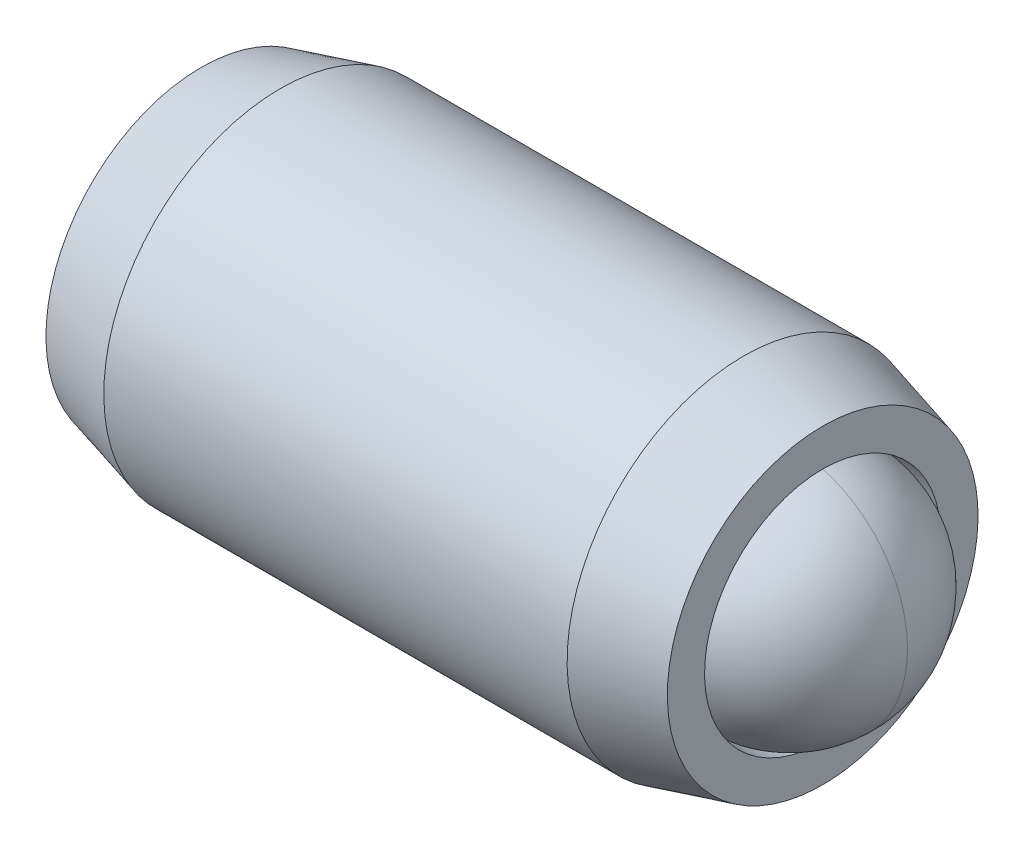
ISO-10303-21;
HEADER;
FILE_DESCRIPTION(('STEP AP214'),'2;1');
FILE_NAME('part.step','',(''),(''),'','','');
FILE_SCHEMA(('AUTOMOTIVE_DESIGN { 1 0 10303 214 1 1 1 1 }'));
ENDSEC;
DATA;
#1=APPLICATION_CONTEXT('core data for automotive mechanical design processes');
#2=APPLICATION_PROTOCOL_DEFINITION('international standard','automotive_design',2000,#1);
#3=PRODUCT_CONTEXT('',#1,'mechanical');
#4=PRODUCT('Part','Part','',(#3));
#5=PRODUCT_RELATED_PRODUCT_CATEGORY('part','',(#4));
#6=PRODUCT_DEFINITION_FORMATION('','',#4);
#7=PRODUCT_DEFINITION_CONTEXT('part definition',#1,'design');
#8=PRODUCT_DEFINITION('design','',#6,#7);
#9=PRODUCT_DEFINITION_SHAPE('','',#8);
#10=(LENGTH_UNIT() NAMED_UNIT(*) SI_UNIT(.MILLI.,.METRE.));
#11=(NAMED_UNIT(*) PLANE_ANGLE_UNIT() SI_UNIT($,.RADIAN.));
#12=(NAMED_UNIT(*) SI_UNIT($,.STERADIAN.) SOLID_ANGLE_UNIT());
#13=UNCERTAINTY_MEASURE_WITH_UNIT(LENGTH_MEASURE(1.E-05),#10,'distance_accuracy_value','');
#14=(GEOMETRIC_REPRESENTATION_CONTEXT(3) GLOBAL_UNCERTAINTY_ASSIGNED_CONTEXT((#13)) GLOBAL_UNIT_ASSIGNED_CONTEXT((#10,
#11,#12)) REPRESENTATION_CONTEXT('',''));
#15=CARTESIAN_POINT('',(0.,0.,0.));
#16=DIRECTION('',(0.,0.,1.));
#17=DIRECTION('',(1.,0.,0.));
#18=AXIS2_PLACEMENT_3D('',#15,#16,#17);
#19=CARTESIAN_POINT('',(-4.77872038568122,1.47543162631791,-0.69225443456844));
#20=DIRECTION('',(-1.,0.,0.));
#21=DIRECTION('',(0.,-1.,0.));
#22=AXIS2_PLACEMENT_3D('',#19,#20,#21);
#23=PLANE('',#22);
#24=DIRECTION('',(0.,0.866025403784439,0.5));
#25=VECTOR('',#24,1.);
#26=CARTESIAN_POINT('',(-4.77872038568122,2.59461912631791,-1.48506460734127));
#27=LINE('',#26,#25);
#28=CARTESIAN_POINT('',(-4.77872038568122,1.47543162631791,-2.13122781173993));
#29=VERTEX_POINT('',#28);
#30=CARTESIAN_POINT('',(-4.77872038568122,2.72161912631791,-1.41174112315419));
#31=VERTEX_POINT('',#30);
#32=EDGE_CURVE('P0_E164',#29,#31,#27,.T.);
#33=ORIENTED_EDGE('',*,*,#32,.T.);
#34=DIRECTION('',(0.,0.,1.));
#35=VECTOR('',#34,1.);
#36=CARTESIAN_POINT('',(-4.77872038568122,2.72161912631791,-0.119414714356857));
#37=LINE('',#36,#35);
#38=CARTESIAN_POINT('',(-4.77872038568122,2.72161912631791,0.0272322540173079));
#39=VERTEX_POINT('',#38);
#40=EDGE_CURVE('P0_E166',#31,#39,#37,.T.);
#41=ORIENTED_EDGE('',*,*,#40,.T.);
#42=DIRECTION('',(0.,-0.866025403784439,0.5));
#43=VECTOR('',#42,1.);
#44=CARTESIAN_POINT('',(-4.77872038568122,1.60243162631791,0.673395458415972));
#45=LINE('',#44,#43);
#46=CARTESIAN_POINT('',(-4.77872038568122,1.47543162631791,0.746718942603055));
#47=VERTEX_POINT('',#46);
#48=EDGE_CURVE('P0_E156',#39,#47,#45,.T.);
#49=ORIENTED_EDGE('',*,*,#48,.T.);
#50=DIRECTION('',(0.,-0.866025403784439,-0.5));
#51=VECTOR('',#50,1.);
#52=CARTESIAN_POINT('',(-4.77872038568122,0.356244126317912,0.100555738204391));
#53=LINE('',#52,#51);
#54=CARTESIAN_POINT('',(-4.77872038568122,0.229244126317913,0.0272322540173086));
#55=VERTEX_POINT('',#54);
#56=EDGE_CURVE('P0_E158',#47,#55,#53,.T.);
#57=ORIENTED_EDGE('',*,*,#56,.T.);
#58=DIRECTION('',(0.,0.,-1.));
#59=VECTOR('',#58,1.);
#60=CARTESIAN_POINT('',(-4.77872038568122,0.229244126317913,-1.26509415478002));
#61=LINE('',#60,#59);
#62=CARTESIAN_POINT('',(-4.77872038568122,0.229244126317913,-1.41174112315419));
#63=VERTEX_POINT('',#62);
#64=EDGE_CURVE('P0_E160',#55,#63,#61,.T.);
#65=ORIENTED_EDGE('',*,*,#64,.T.);
#66=DIRECTION('',(0.,0.866025403784439,-0.5));
#67=VECTOR('',#66,1.);
#68=CARTESIAN_POINT('',(-4.77872038568122,1.34843162631791,-2.05790432755285));
#69=LINE('',#68,#67);
#70=EDGE_CURVE('P0_E162',#63,#29,#69,.T.);
#71=ORIENTED_EDGE('',*,*,#70,.T.);
#72=EDGE_LOOP('',(#33,#41,#49,#57,#65,#71));
#73=FACE_BOUND('',#72,.T.);
#74=CARTESIAN_POINT('',(-4.77872038568122,1.47543162631791,-0.69225443456844));
#75=DIRECTION('',(1.,0.,0.));
#76=DIRECTION('',(0.,1.,0.));
#77=AXIS2_PLACEMENT_3D('',#74,#75,#76);
#78=CIRCLE('',#77,2.0955);
#79=CARTESIAN_POINT('',(-4.77872038568122,3.57093162631791,-0.69225443456844));
#80=VERTEX_POINT('',#79);
#81=EDGE_CURVE('P0_E150',#80,#80,#78,.T.);
#82=ORIENTED_EDGE('',*,*,#81,.F.);
#83=EDGE_LOOP('',(#82));
#84=FACE_BOUND('',#83,.T.);
#85=ADVANCED_FACE('P0_F17',(#73,#84),#23,.T.);
#86=CARTESIAN_POINT('',(-3.71228686741842,1.47543162631791,-0.69225443456844));
#87=DIRECTION('',(1.,0.,0.));
#88=DIRECTION('',(0.,1.,0.));
#89=AXIS2_PLACEMENT_3D('',#86,#87,#88);
#90=CONICAL_SURFACE('',#89,2.38125,0.26179938779915);
#91=ORIENTED_EDGE('',*,*,#81,.T.);
#92=EDGE_LOOP('',(#91));
#93=FACE_BOUND('',#92,.T.);
#94=CARTESIAN_POINT('',(-3.71228686741842,1.47543162631791,-0.69225443456844));
#95=DIRECTION('',(1.,0.,0.));
#96=DIRECTION('',(0.,1.,0.));
#97=AXIS2_PLACEMENT_3D('',#94,#95,#96);
#98=CIRCLE('',#97,2.38125);
#99=CARTESIAN_POINT('',(-3.71228686741842,3.85668162631791,-0.69225443456844));
#100=VERTEX_POINT('',#99);
#101=EDGE_CURVE('P0_E147',#100,#100,#98,.T.);
#102=ORIENTED_EDGE('',*,*,#101,.F.);
#103=EDGE_LOOP('',(#102));
#104=FACE_BOUND('',#103,.T.);
#105=ADVANCED_FACE('P0_F225',(#93,#104),#90,.T.);
#106=CARTESIAN_POINT('',(0.913715584051493,1.47543162631791,-0.69225443456844));
#107=DIRECTION('',(1.,0.,0.));
#108=DIRECTION('',(0.,1.,0.));
#109=AXIS2_PLACEMENT_3D('',#106,#107,#108);
#110=CYLINDRICAL_SURFACE('',#109,2.38125);
#111=ORIENTED_EDGE('',*,*,#101,.T.);
#112=EDGE_LOOP('',(#111));
#113=FACE_BOUND('',#112,.T.);
#114=CARTESIAN_POINT('',(2.53684609605597,1.47543162631791,-0.69225443456844));
#115=DIRECTION('',(1.,0.,0.));
#116=DIRECTION('',(0.,1.,0.));
#117=AXIS2_PLACEMENT_3D('',#114,#115,#116);
#118=CIRCLE('',#117,2.38125);
#119=CARTESIAN_POINT('',(2.53684609605597,3.85668162631791,-0.69225443456844));
#120=VERTEX_POINT('',#119);
#121=EDGE_CURVE('P0_E144',#120,#120,#118,.T.);
#122=ORIENTED_EDGE('',*,*,#121,.F.);
#123=EDGE_LOOP('',(#122));
#124=FACE_BOUND('',#123,.T.);
#125=ADVANCED_FACE('P0_F231',(#113,#124),#110,.T.);
#126=CARTESIAN_POINT('',(3.60327961431878,1.47543162631791,-0.69225443456844));
#127=DIRECTION('',(-1.,0.,0.));
#128=DIRECTION('',(0.,-1.,0.));
#129=AXIS2_PLACEMENT_3D('',#126,#127,#128);
#130=CONICAL_SURFACE('',#129,2.0955,0.261799387799151);
#131=ORIENTED_EDGE('',*,*,#121,.T.);
#132=EDGE_LOOP('',(#131));
#133=FACE_BOUND('',#132,.T.);
#134=CARTESIAN_POINT('',(3.60327961431878,1.47543162631791,-0.69225443456844));
#135=DIRECTION('',(1.,0.,0.));
#136=DIRECTION('',(0.,1.,0.));
#137=AXIS2_PLACEMENT_3D('',#134,#135,#136);
#138=CIRCLE('',#137,2.0955);
#139=CARTESIAN_POINT('',(3.60327961431878,3.57093162631791,-0.69225443456844));
#140=VERTEX_POINT('',#139);
#141=EDGE_CURVE('P0_E141',#140,#140,#138,.T.);
#142=ORIENTED_EDGE('',*,*,#141,.F.);
#143=EDGE_LOOP('',(#142));
#144=FACE_BOUND('',#143,.T.);
#145=ADVANCED_FACE('P0_F275',(#133,#144),#130,.T.);
#146=CARTESIAN_POINT('',(3.60327961431878,3.57093162631791,-0.69225443456844));
#147=DIRECTION('',(1.,0.,0.));
#148=DIRECTION('',(0.,1.,0.));
#149=AXIS2_PLACEMENT_3D('',#146,#147,#148);
#150=PLANE('',#149);
#151=ORIENTED_EDGE('',*,*,#141,.T.);
#152=EDGE_LOOP('',(#151));
#153=FACE_BOUND('',#152,.T.);
#154=CARTESIAN_POINT('',(3.60327961431878,1.47543162631791,-0.69225443456844));
#155=DIRECTION('',(1.,0.,0.));
#156=DIRECTION('',(0.,1.,0.));
#157=AXIS2_PLACEMENT_3D('',#154,#155,#156);
#158=CIRCLE('',#157,1.59385);
#159=CARTESIAN_POINT('',(3.60327961431878,3.06928162631791,-0.69225443456844));
#160=VERTEX_POINT('',#159);
#161=EDGE_CURVE('P0_E138',#160,#160,#158,.T.);
#162=ORIENTED_EDGE('',*,*,#161,.F.);
#163=EDGE_LOOP('',(#162));
#164=FACE_BOUND('',#163,.T.);
#165=ADVANCED_FACE('P0_F271',(#153,#164),#150,.T.);
#166=CARTESIAN_POINT('',(0.913715584051493,1.47543162631791,-0.69225443456844));
#167=DIRECTION('',(1.,0.,0.));
#168=DIRECTION('',(0.,1.,0.));
#169=AXIS2_PLACEMENT_3D('',#166,#167,#168);
#170=CYLINDRICAL_SURFACE('',#169,1.59385);
#171=ORIENTED_EDGE('',*,*,#161,.T.);
#172=EDGE_LOOP('',(#171));
#173=FACE_BOUND('',#172,.T.);
#174=CARTESIAN_POINT('',(2.50756558405149,1.47543162631791,-0.69225443456844));
#175=DIRECTION('',(1.,0.,0.));
#176=DIRECTION('',(0.,1.,0.));
#177=AXIS2_PLACEMENT_3D('',#174,#175,#176);
#178=CIRCLE('',#177,1.59385);
#179=CARTESIAN_POINT('',(2.50756558405149,3.06928162631791,-0.69225443456844));
#180=VERTEX_POINT('',#179);
#181=EDGE_CURVE('P0_E126',#180,#180,#178,.T.);
#182=ORIENTED_EDGE('',*,*,#181,.F.);
#183=EDGE_LOOP('',(#182));
#184=FACE_BOUND('',#183,.T.);
#185=ADVANCED_FACE('P0_F267',(#173,#184),#170,.F.);
#186=CARTESIAN_POINT('',(0.913715584051493,1.47543162631791,-0.69225443456844));
#187=DIRECTION('',(1.,0.,0.));
#188=DIRECTION('',(0.,1.,0.));
#189=AXIS2_PLACEMENT_3D('',#186,#187,#188);
#190=CONICAL_SURFACE('',#189,0.,0.78539816339745);
#191=ORIENTED_EDGE('',*,*,#181,.T.);
#192=EDGE_LOOP('',(#191));
#193=FACE_BOUND('',#192,.T.);
#194=CARTESIAN_POINT('',(0.913715584051493,1.47543162631791,-0.69225443456844));
#195=VERTEX_POINT('',#194);
#196=VERTEX_LOOP('',#195);
#197=FACE_BOUND('',#196,.T.);
#198=ADVANCED_FACE('P0_F221',(#193,#197),#190,.F.);
#199=CARTESIAN_POINT('',(-1.73072038568122,0.483244126317913,-0.119414714356857));
#200=DIRECTION('',(0.,-0.5,0.866025403784439));
#201=DIRECTION('',(0.,-0.866025403784439,-0.5));
#202=AXIS2_PLACEMENT_3D('',#199,#200,#201);
#203=PLANE('',#202);
#204=DIRECTION('',(-1.,0.,0.));
#205=VECTOR('',#204,1.);
#206=CARTESIAN_POINT('',(-1.73072038568122,0.483244126317913,-0.119414714356857));
#207=LINE('',#206,#205);
#208=CARTESIAN_POINT('',(-1.73072038568122,0.483244126317913,-0.119414714356857));
#209=VERTEX_POINT('',#208);
#210=CARTESIAN_POINT('',(-4.52472038568122,0.483244126317913,-0.119414714356857));
#211=VERTEX_POINT('',#210);
#212=EDGE_CURVE('P0_E124',#209,#211,#207,.T.);
#213=ORIENTED_EDGE('',*,*,#212,.T.);
#214=DIRECTION('',(0.,0.866025403784439,0.5));
#215=VECTOR('',#214,1.);
#216=CARTESIAN_POINT('',(-4.52472038568122,1.47543162631791,0.453425005854725));
#217=LINE('',#216,#215);
#218=CARTESIAN_POINT('',(-4.52472038568122,1.47543162631791,0.453425005854725));
#219=VERTEX_POINT('',#218);
#220=EDGE_CURVE('P0_E26',#211,#219,#217,.T.);
#221=ORIENTED_EDGE('',*,*,#220,.T.);
#222=DIRECTION('',(-1.,0.,0.));
#223=VECTOR('',#222,1.);
#224=CARTESIAN_POINT('',(-1.73072038568122,1.47543162631791,0.453425005854725));
#225=LINE('',#224,#223);
#226=CARTESIAN_POINT('',(-1.73072038568122,1.47543162631791,0.453425005854725));
#227=VERTEX_POINT('',#226);
#228=EDGE_CURVE('P0_E90',#227,#219,#225,.T.);
#229=ORIENTED_EDGE('',*,*,#228,.F.);
#230=DIRECTION('',(0.,0.866025403784439,0.5));
#231=VECTOR('',#230,1.);
#232=CARTESIAN_POINT('',(-1.73072038568122,0.483244126317913,-0.119414714356857));
#233=LINE('',#232,#231);
#234=EDGE_CURVE('P0_E94',#209,#227,#233,.T.);
#235=ORIENTED_EDGE('',*,*,#234,.F.);
#236=EDGE_LOOP('',(#213,#221,#229,#235));
#237=FACE_BOUND('',#236,.T.);
#238=ADVANCED_FACE('P0_F92',(#237),#203,.F.);
#239=CARTESIAN_POINT('',(-1.73072038568122,0.483244126317913,-1.26509415478002));
#240=DIRECTION('',(0.,-1.,0.));
#241=DIRECTION('',(1.,0.,0.));
#242=AXIS2_PLACEMENT_3D('',#239,#240,#241);
#243=PLANE('',#242);
#244=DIRECTION('',(-1.,0.,0.));
#245=VECTOR('',#244,1.);
#246=CARTESIAN_POINT('',(-1.73072038568122,0.483244126317913,-1.26509415478002));
#247=LINE('',#246,#245);
#248=CARTESIAN_POINT('',(-1.73072038568122,0.483244126317913,-1.26509415478002));
#249=VERTEX_POINT('',#248);
#250=CARTESIAN_POINT('',(-4.52472038568122,0.483244126317913,-1.26509415478002));
#251=VERTEX_POINT('',#250);
#252=EDGE_CURVE('P0_E127',#249,#251,#247,.T.);
#253=ORIENTED_EDGE('',*,*,#252,.T.);
#254=DIRECTION('',(0.,0.,1.));
#255=VECTOR('',#254,1.);
#256=CARTESIAN_POINT('',(-4.52472038568122,0.483244126317913,-0.119414714356857));
#257=LINE('',#256,#255);
#258=EDGE_CURVE('P0_E41',#251,#211,#257,.T.);
#259=ORIENTED_EDGE('',*,*,#258,.T.);
#260=ORIENTED_EDGE('',*,*,#212,.F.);
#261=DIRECTION('',(0.,0.,1.));
#262=VECTOR('',#261,1.);
#263=CARTESIAN_POINT('',(-1.73072038568122,0.483244126317913,-1.26509415478002));
#264=LINE('',#263,#262);
#265=EDGE_CURVE('P0_E99',#249,#209,#264,.T.);
#266=ORIENTED_EDGE('',*,*,#265,.F.);
#267=EDGE_LOOP('',(#253,#259,#260,#266));
#268=FACE_BOUND('',#267,.T.);
#269=ADVANCED_FACE('P0_F212',(#268),#243,.F.);
#270=CARTESIAN_POINT('',(-1.73072038568122,1.47543162631791,-1.8379338749916));
#271=DIRECTION('',(0.,-0.5,-0.866025403784439));
#272=DIRECTION('',(0.,0.866025403784439,-0.5));
#273=AXIS2_PLACEMENT_3D('',#270,#271,#272);
#274=PLANE('',#273);
#275=DIRECTION('',(-1.,0.,0.));
#276=VECTOR('',#275,1.);
#277=CARTESIAN_POINT('',(-1.73072038568122,1.47543162631791,-1.8379338749916));
#278=LINE('',#277,#276);
#279=CARTESIAN_POINT('',(-1.73072038568122,1.47543162631791,-1.8379338749916));
#280=VERTEX_POINT('',#279);
#281=CARTESIAN_POINT('',(-4.52472038568122,1.47543162631791,-1.8379338749916));
#282=VERTEX_POINT('',#281);
#283=EDGE_CURVE('P0_E129',#280,#282,#278,.T.);
#284=ORIENTED_EDGE('',*,*,#283,.T.);
#285=DIRECTION('',(0.,-0.866025403784439,0.5));
#286=VECTOR('',#285,1.);
#287=CARTESIAN_POINT('',(-4.52472038568122,0.483244126317913,-1.26509415478002));
#288=LINE('',#287,#286);
#289=EDGE_CURVE('P0_E171',#282,#251,#288,.T.);
#290=ORIENTED_EDGE('',*,*,#289,.T.);
#291=ORIENTED_EDGE('',*,*,#252,.F.);
#292=DIRECTION('',(0.,-0.866025403784439,0.5));
#293=VECTOR('',#292,1.);
#294=CARTESIAN_POINT('',(-1.73072038568122,1.47543162631791,-1.8379338749916));
#295=LINE('',#294,#293);
#296=EDGE_CURVE('P0_E121',#280,#249,#295,.T.);
#297=ORIENTED_EDGE('',*,*,#296,.F.);
#298=EDGE_LOOP('',(#284,#290,#291,#297));
#299=FACE_BOUND('',#298,.T.);
#300=ADVANCED_FACE('P0_F211',(#299),#274,.F.);
#301=CARTESIAN_POINT('',(-1.73072038568122,2.46761912631791,-1.26509415478002));
#302=DIRECTION('',(0.,0.5,-0.866025403784439));
#303=DIRECTION('',(0.,0.866025403784439,0.5));
#304=AXIS2_PLACEMENT_3D('',#301,#302,#303);
#305=PLANE('',#304);
#306=DIRECTION('',(-1.,0.,0.));
#307=VECTOR('',#306,1.);
#308=CARTESIAN_POINT('',(-1.73072038568122,2.46761912631791,-1.26509415478002));
#309=LINE('',#308,#307);
#310=CARTESIAN_POINT('',(-1.73072038568122,2.46761912631791,-1.26509415478002));
#311=VERTEX_POINT('',#310);
#312=CARTESIAN_POINT('',(-4.52472038568122,2.46761912631791,-1.26509415478002));
#313=VERTEX_POINT('',#312);
#314=EDGE_CURVE('P0_E132',#311,#313,#309,.T.);
#315=ORIENTED_EDGE('',*,*,#314,.T.);
#316=DIRECTION('',(0.,-0.866025403784439,-0.5));
#317=VECTOR('',#316,1.);
#318=CARTESIAN_POINT('',(-4.52472038568122,1.47543162631791,-1.8379338749916));
#319=LINE('',#318,#317);
#320=EDGE_CURVE('P0_E169',#313,#282,#319,.T.);
#321=ORIENTED_EDGE('',*,*,#320,.T.);
#322=ORIENTED_EDGE('',*,*,#283,.F.);
#323=DIRECTION('',(0.,-0.866025403784439,-0.5));
#324=VECTOR('',#323,1.);
#325=CARTESIAN_POINT('',(-1.73072038568122,2.46761912631791,-1.26509415478002));
#326=LINE('',#325,#324);
#327=EDGE_CURVE('P0_E118',#311,#280,#326,.T.);
#328=ORIENTED_EDGE('',*,*,#327,.F.);
#329=EDGE_LOOP('',(#315,#321,#322,#328));
#330=FACE_BOUND('',#329,.T.);
#331=ADVANCED_FACE('P0_F208',(#330),#305,.F.);
#332=CARTESIAN_POINT('',(-1.73072038568122,2.46761912631791,-0.119414714356857));
#333=DIRECTION('',(0.,1.,0.));
#334=DIRECTION('',(-1.,0.,0.));
#335=AXIS2_PLACEMENT_3D('',#332,#333,#334);
#336=PLANE('',#335);
#337=DIRECTION('',(-1.,0.,0.));
#338=VECTOR('',#337,1.);
#339=CARTESIAN_POINT('',(-1.73072038568122,2.46761912631791,-0.119414714356857));
#340=LINE('',#339,#338);
#341=CARTESIAN_POINT('',(-1.73072038568122,2.46761912631791,-0.119414714356857));
#342=VERTEX_POINT('',#341);
#343=CARTESIAN_POINT('',(-4.52472038568122,2.46761912631791,-0.119414714356857));
#344=VERTEX_POINT('',#343);
#345=EDGE_CURVE('P0_E98',#342,#344,#340,.T.);
#346=ORIENTED_EDGE('',*,*,#345,.T.);
#347=DIRECTION('',(0.,0.,-1.));
#348=VECTOR('',#347,1.);
#349=CARTESIAN_POINT('',(-4.52472038568122,2.46761912631791,-1.26509415478002));
#350=LINE('',#349,#348);
#351=EDGE_CURVE('P0_E153',#344,#313,#350,.T.);
#352=ORIENTED_EDGE('',*,*,#351,.T.);
#353=ORIENTED_EDGE('',*,*,#314,.F.);
#354=DIRECTION('',(0.,0.,-1.));
#355=VECTOR('',#354,1.);
#356=CARTESIAN_POINT('',(-1.73072038568122,2.46761912631791,-0.119414714356857));
#357=LINE('',#356,#355);
#358=EDGE_CURVE('P0_E108',#342,#311,#357,.T.);
#359=ORIENTED_EDGE('',*,*,#358,.F.);
#360=EDGE_LOOP('',(#346,#352,#353,#359));
#361=FACE_BOUND('',#360,.T.);
#362=ADVANCED_FACE('P0_F204',(#361),#336,.F.);
#363=CARTESIAN_POINT('',(-1.73072038568122,1.47543162631791,0.453425005854725));
#364=DIRECTION('',(0.,0.5,0.866025403784439));
#365=DIRECTION('',(0.,-0.866025403784439,0.5));
#366=AXIS2_PLACEMENT_3D('',#363,#364,#365);
#367=PLANE('',#366);
#368=ORIENTED_EDGE('',*,*,#228,.T.);
#369=DIRECTION('',(0.,0.866025403784439,-0.5));
#370=VECTOR('',#369,1.);
#371=CARTESIAN_POINT('',(-4.52472038568122,2.46761912631791,-0.119414714356857));
#372=LINE('',#371,#370);
#373=EDGE_CURVE('P0_E11',#219,#344,#372,.T.);
#374=ORIENTED_EDGE('',*,*,#373,.T.);
#375=ORIENTED_EDGE('',*,*,#345,.F.);
#376=DIRECTION('',(0.,0.866025403784439,-0.5));
#377=VECTOR('',#376,1.);
#378=CARTESIAN_POINT('',(-1.73072038568122,1.47543162631791,0.453425005854725));
#379=LINE('',#378,#377);
#380=EDGE_CURVE('P0_E102',#227,#342,#379,.T.);
#381=ORIENTED_EDGE('',*,*,#380,.F.);
#382=EDGE_LOOP('',(#368,#374,#375,#381));
#383=FACE_BOUND('',#382,.T.);
#384=ADVANCED_FACE('P0_F103',(#383),#367,.F.);
#385=CARTESIAN_POINT('',(-1.73072038568122,2.46761912631791,1.02626472606631));
#386=DIRECTION('',(-1.,0.,0.));
#387=DIRECTION('',(0.,0.,1.));
#388=AXIS2_PLACEMENT_3D('',#385,#386,#387);
#389=PLANE('',#388);
#390=ORIENTED_EDGE('',*,*,#234,.T.);
#391=ORIENTED_EDGE('',*,*,#380,.T.);
#392=ORIENTED_EDGE('',*,*,#358,.T.);
#393=ORIENTED_EDGE('',*,*,#327,.T.);
#394=ORIENTED_EDGE('',*,*,#296,.T.);
#395=ORIENTED_EDGE('',*,*,#265,.T.);
#396=EDGE_LOOP('',(#390,#391,#392,#393,#394,#395));
#397=FACE_BOUND('',#396,.T.);
#398=ADVANCED_FACE('P0_F110',(#397),#389,.T.);
#399=CARTESIAN_POINT('',(-4.52472038568122,0.483244126317913,-1.26509415478002));
#400=DIRECTION('',(-0.707106781186547,0.707106781186548,0.));
#401=DIRECTION('',(-0.707106781186548,-0.707106781186547,0.));
#402=AXIS2_PLACEMENT_3D('',#399,#400,#401);
#403=PLANE('',#402);
#404=DIRECTION('',(-0.654653670707978,-0.654653670707976,-0.377964473009227));
#405=VECTOR('',#404,1.);
#406=CARTESIAN_POINT('',(-4.24123824282408,0.766726269175055,-1.101425663291));
#407=LINE('',#406,#405);
#408=EDGE_CURVE('P0_E115',#63,#251,#407,.F.);
#409=ORIENTED_EDGE('',*,*,#408,.F.);
#410=ORIENTED_EDGE('',*,*,#64,.F.);
#411=DIRECTION('',(-0.654653670707978,-0.654653670707976,0.377964473009229));
#412=VECTOR('',#411,1.);
#413=CARTESIAN_POINT('',(-4.24123824282408,0.766726269175057,-0.283083205845882));
#414=LINE('',#413,#412);
#415=EDGE_CURVE('P0_E21',#211,#55,#414,.T.);
#416=ORIENTED_EDGE('',*,*,#415,.F.);
#417=ORIENTED_EDGE('',*,*,#258,.F.);
#418=EDGE_LOOP('',(#409,#410,#416,#417));
#419=FACE_BOUND('',#418,.T.);
#420=ADVANCED_FACE('P0_F19',(#419),#403,.T.);
#421=CARTESIAN_POINT('',(-4.52472038568122,0.483244126317913,-0.119414714356857));
#422=DIRECTION('',(-0.707106781186548,0.353553390593274,-0.612372435695794));
#423=DIRECTION('',(-0.654653670707977,0.,0.755928946018455));
#424=AXIS2_PLACEMENT_3D('',#421,#422,#423);
#425=PLANE('',#424);
#426=ORIENTED_EDGE('',*,*,#415,.T.);
#427=ORIENTED_EDGE('',*,*,#56,.F.);
#428=DIRECTION('',(-0.654653670707977,0.,0.755928946018454));
#429=VECTOR('',#428,1.);
#430=CARTESIAN_POINT('',(-4.24123824282408,1.47543162631791,0.126088022876679));
#431=LINE('',#430,#429);
#432=EDGE_CURVE('P0_E182',#219,#47,#431,.T.);
#433=ORIENTED_EDGE('',*,*,#432,.F.);
#434=ORIENTED_EDGE('',*,*,#220,.F.);
#435=EDGE_LOOP('',(#426,#427,#433,#434));
#436=FACE_BOUND('',#435,.T.);
#437=ADVANCED_FACE('P0_F196',(#436),#425,.T.);
#438=CARTESIAN_POINT('',(-4.52472038568122,1.47543162631791,-1.8379338749916));
#439=DIRECTION('',(-0.707106781186547,0.353553390593274,0.612372435695795));
#440=DIRECTION('',(0.654653670707978,0.,0.755928946018454));
#441=AXIS2_PLACEMENT_3D('',#438,#439,#440);
#442=PLANE('',#441);
#443=ORIENTED_EDGE('',*,*,#408,.T.);
#444=ORIENTED_EDGE('',*,*,#289,.F.);
#445=DIRECTION('',(-0.654653670707978,0.,-0.755928946018454));
#446=VECTOR('',#445,1.);
#447=CARTESIAN_POINT('',(-4.24123824282408,1.47543162631791,-1.51059689201356));
#448=LINE('',#447,#446);
#449=EDGE_CURVE('P0_E179',#29,#282,#448,.F.);
#450=ORIENTED_EDGE('',*,*,#449,.F.);
#451=ORIENTED_EDGE('',*,*,#70,.F.);
#452=EDGE_LOOP('',(#443,#444,#450,#451));
#453=FACE_BOUND('',#452,.T.);
#454=ADVANCED_FACE('P0_F189',(#453),#442,.T.);
#455=CARTESIAN_POINT('',(-4.52472038568122,1.47543162631791,0.453425005854725));
#456=DIRECTION('',(-0.707106781186547,-0.353553390593274,-0.612372435695795));
#457=DIRECTION('',(-0.654653670707977,0.,0.755928946018454));
#458=AXIS2_PLACEMENT_3D('',#455,#456,#457);
#459=PLANE('',#458);
#460=ORIENTED_EDGE('',*,*,#432,.T.);
#461=ORIENTED_EDGE('',*,*,#48,.F.);
#462=DIRECTION('',(0.654653670707978,-0.654653670707977,-0.377964473009227));
#463=VECTOR('',#462,1.);
#464=CARTESIAN_POINT('',(-4.52472038568122,2.46761912631791,-0.119414714356857));
#465=LINE('',#464,#463);
#466=EDGE_CURVE('P0_E177',#344,#39,#465,.F.);
#467=ORIENTED_EDGE('',*,*,#466,.F.);
#468=ORIENTED_EDGE('',*,*,#373,.F.);
#469=EDGE_LOOP('',(#460,#461,#467,#468));
#470=FACE_BOUND('',#469,.T.);
#471=ADVANCED_FACE('P0_F201',(#470),#459,.T.);
#472=CARTESIAN_POINT('',(-4.52472038568122,2.46761912631791,-1.26509415478002));
#473=DIRECTION('',(-0.707106781186547,-0.353553390593274,0.612372435695795));
#474=DIRECTION('',(0.654653670707977,0.,0.755928946018454));
#475=AXIS2_PLACEMENT_3D('',#472,#473,#474);
#476=PLANE('',#475);
#477=ORIENTED_EDGE('',*,*,#449,.T.);
#478=ORIENTED_EDGE('',*,*,#320,.F.);
#479=DIRECTION('',(-0.654653670707978,0.654653670707977,-0.377964473009227));
#480=VECTOR('',#479,1.);
#481=CARTESIAN_POINT('',(-4.24123824282408,2.18413698346077,-1.101425663291));
#482=LINE('',#481,#480);
#483=EDGE_CURVE('P0_E175',#31,#313,#482,.F.);
#484=ORIENTED_EDGE('',*,*,#483,.F.);
#485=ORIENTED_EDGE('',*,*,#32,.F.);
#486=EDGE_LOOP('',(#477,#478,#484,#485));
#487=FACE_BOUND('',#486,.T.);
#488=ADVANCED_FACE('P0_F240',(#487),#476,.T.);
#489=CARTESIAN_POINT('',(-4.52472038568122,2.46761912631791,-0.119414714356857));
#490=DIRECTION('',(-0.707106781186547,-0.707106781186548,0.));
#491=DIRECTION('',(0.707106781186548,-0.707106781186547,0.));
#492=AXIS2_PLACEMENT_3D('',#489,#490,#491);
#493=PLANE('',#492);
#494=ORIENTED_EDGE('',*,*,#466,.T.);
#495=ORIENTED_EDGE('',*,*,#40,.F.);
#496=ORIENTED_EDGE('',*,*,#483,.T.);
#497=ORIENTED_EDGE('',*,*,#351,.F.);
#498=EDGE_LOOP('',(#494,#495,#496,#497));
#499=FACE_BOUND('',#498,.T.);
#500=ADVANCED_FACE('P0_F237',(#499),#493,.T.);
#501=CLOSED_SHELL('',(#85,#105,#125,#145,#165,#185,#198,#238,#269,#300,#331,#362,#384,#398,#420,
#437,#454,#471,#488,#500));
#502=MANIFOLD_SOLID_BREP('P0_B1',#501);
#503=CARTESIAN_POINT('',(3.15877961431878,1.47543162631792,-0.69225443456844));
#504=DIRECTION('',(0.,-0.999344235574586,0.0362090986334314));
#505=DIRECTION('',(1.,0.,0.));
#506=AXIS2_PLACEMENT_3D('',#503,#504,#505);
#507=SPHERICAL_SURFACE('',#506,1.5875);
#508=CARTESIAN_POINT('',(3.15877961431878,1.47543162631792,-0.69225443456844));
#509=DIRECTION('',(0.,0.0362090986334314,0.999344235574586));
#510=DIRECTION('',(1.,0.,0.));
#511=AXIS2_PLACEMENT_3D('',#508,#509,#510);
#512=CIRCLE('',#511,1.5875);
#513=CARTESIAN_POINT('',(3.15877961431878,3.06189060029257,-0.749736378649012));
#514=VERTEX_POINT('',#513);
#515=CARTESIAN_POINT('',(3.15877961431878,-0.111027347656741,-0.634772490487868));
#516=VERTEX_POINT('',#515);
#517=EDGE_CURVE('P1_E37',#514,#516,#512,.T.);
#518=ORIENTED_EDGE('',*,*,#517,.F.);
#519=CARTESIAN_POINT('',(3.15877961431878,1.47543162631792,-0.69225443456844));
#520=DIRECTION('',(-1.,0.,0.));
#521=DIRECTION('',(0.,0.0362090986334314,0.999344235574586));
#522=AXIS2_PLACEMENT_3D('',#519,#520,#521);
#523=CIRCLE('',#522,1.5875);
#524=EDGE_CURVE('P1_E10',#514,#516,#523,.T.);
#525=ORIENTED_EDGE('',*,*,#524,.T.);
#526=EDGE_LOOP('',(#518,#525));
#527=FACE_BOUND('',#526,.T.);
#528=ADVANCED_FACE('P1_F16',(#527),#507,.T.);
#529=ORIENTED_EDGE('',*,*,#517,.T.);
#530=CARTESIAN_POINT('',(3.15877961431878,1.47543162631792,-0.69225443456844));
#531=DIRECTION('',(-1.,0.,0.));
#532=DIRECTION('',(0.,0.0362090986334314,0.999344235574586));
#533=AXIS2_PLACEMENT_3D('',#530,#531,#532);
#534=CIRCLE('',#533,1.5875);
#535=EDGE_CURVE('P1_E23',#516,#514,#534,.T.);
#536=ORIENTED_EDGE('',*,*,#535,.T.);
#537=EDGE_LOOP('',(#529,#536));
#538=FACE_BOUND('',#537,.T.);
#539=ADVANCED_FACE('P1_F36',(#538),#507,.T.);
#540=ORIENTED_EDGE('',*,*,#535,.F.);
#541=EDGE_CURVE('P1_E33',#516,#514,#512,.T.);
#542=ORIENTED_EDGE('',*,*,#541,.T.);
#543=EDGE_LOOP('',(#540,#542));
#544=FACE_BOUND('',#543,.T.);
#545=ADVANCED_FACE('P1_F39',(#544),#507,.T.);
#546=ORIENTED_EDGE('',*,*,#524,.F.);
#547=ORIENTED_EDGE('',*,*,#541,.F.);
#548=EDGE_LOOP('',(#546,#547));
#549=FACE_BOUND('',#548,.T.);
#550=ADVANCED_FACE('P1_F18',(#549),#507,.T.);
#551=CLOSED_SHELL('',(#528,#539,#545,#550));
#552=MANIFOLD_SOLID_BREP('P1_B1',#551);
#553=ADVANCED_BREP_SHAPE_REPRESENTATION('',(#18,#502,#552),#14);
#554=SHAPE_DEFINITION_REPRESENTATION(#9,#553);
ENDSEC;
END-ISO-10303-21;
